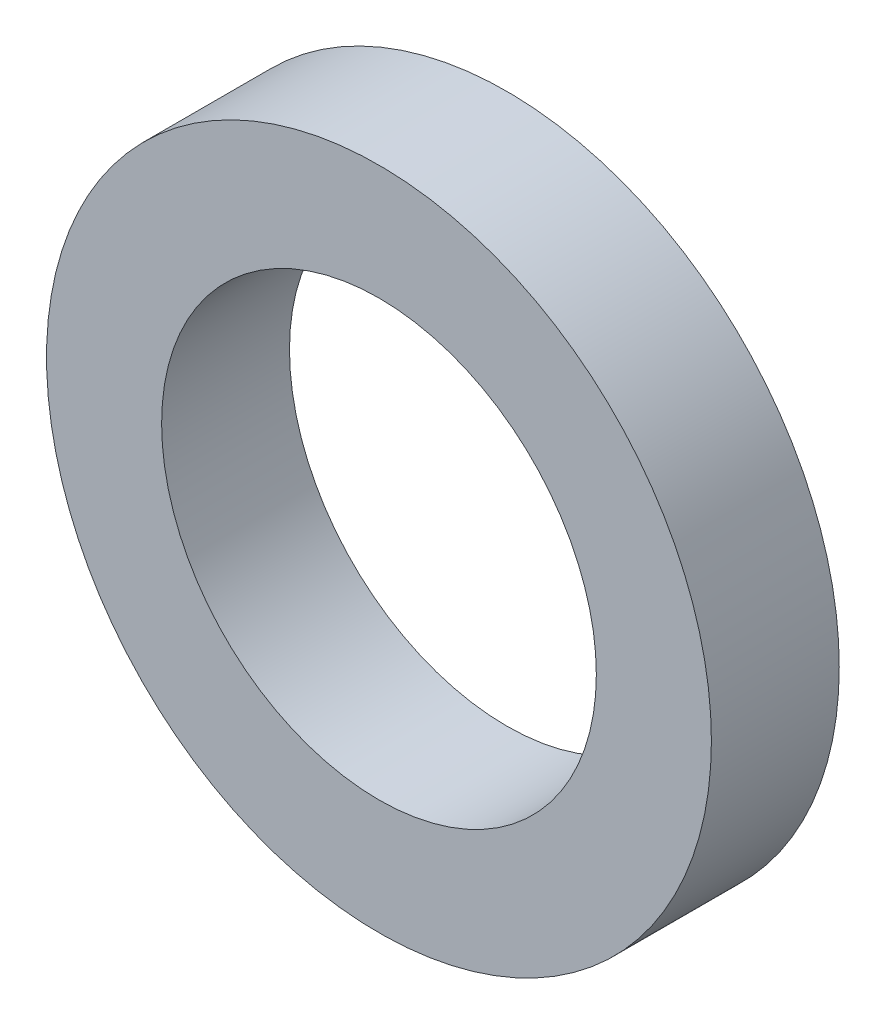
ISO-10303-21;
HEADER;
FILE_DESCRIPTION(('STEP AP214'),'2;1');
FILE_NAME('part.step','',(''),(''),'','','');
FILE_SCHEMA(('AUTOMOTIVE_DESIGN { 1 0 10303 214 1 1 1 1 }'));
ENDSEC;
DATA;
#1=APPLICATION_CONTEXT('core data for automotive mechanical design processes');
#2=APPLICATION_PROTOCOL_DEFINITION('international standard','automotive_design',2000,#1);
#3=PRODUCT_CONTEXT('',#1,'mechanical');
#4=PRODUCT('Part','Part','',(#3));
#5=PRODUCT_RELATED_PRODUCT_CATEGORY('part','',(#4));
#6=PRODUCT_DEFINITION_FORMATION('','',#4);
#7=PRODUCT_DEFINITION_CONTEXT('part definition',#1,'design');
#8=PRODUCT_DEFINITION('design','',#6,#7);
#9=PRODUCT_DEFINITION_SHAPE('','',#8);
#10=(LENGTH_UNIT() NAMED_UNIT(*) SI_UNIT(.MILLI.,.METRE.));
#11=(NAMED_UNIT(*) PLANE_ANGLE_UNIT() SI_UNIT($,.RADIAN.));
#12=(NAMED_UNIT(*) SI_UNIT($,.STERADIAN.) SOLID_ANGLE_UNIT());
#13=UNCERTAINTY_MEASURE_WITH_UNIT(LENGTH_MEASURE(1.E-05),#10,'distance_accuracy_value','');
#14=(GEOMETRIC_REPRESENTATION_CONTEXT(3) GLOBAL_UNCERTAINTY_ASSIGNED_CONTEXT((#13)) GLOBAL_UNIT_ASSIGNED_CONTEXT((#10,
#11,#12)) REPRESENTATION_CONTEXT('',''));
#15=CARTESIAN_POINT('',(0.,0.,0.));
#16=DIRECTION('',(0.,0.,1.));
#17=DIRECTION('',(1.,0.,0.));
#18=AXIS2_PLACEMENT_3D('',#15,#16,#17);
#19=CARTESIAN_POINT('',(0.,0.,5.));
#20=DIRECTION('',(0.,0.,-1.));
#21=DIRECTION('',(-1.,0.,0.));
#22=AXIS2_PLACEMENT_3D('',#19,#20,#21);
#23=CYLINDRICAL_SURFACE('',#22,13.);
#24=CARTESIAN_POINT('',(0.,0.,5.));
#25=DIRECTION('',(0.,0.,1.));
#26=DIRECTION('',(1.,0.,0.));
#27=AXIS2_PLACEMENT_3D('',#24,#25,#26);
#28=CIRCLE('',#27,13.);
#29=CARTESIAN_POINT('',(13.,0.,5.));
#30=VERTEX_POINT('',#29);
#31=EDGE_CURVE('E10',#30,#30,#28,.T.);
#32=ORIENTED_EDGE('',*,*,#31,.F.);
#33=EDGE_LOOP('',(#32));
#34=FACE_BOUND('',#33,.T.);
#35=CARTESIAN_POINT('',(0.,0.,0.));
#36=DIRECTION('',(0.,0.,1.));
#37=DIRECTION('',(1.,0.,0.));
#38=AXIS2_PLACEMENT_3D('',#35,#36,#37);
#39=CIRCLE('',#38,13.);
#40=CARTESIAN_POINT('',(13.,0.,0.));
#41=VERTEX_POINT('',#40);
#42=EDGE_CURVE('E42',#41,#41,#39,.T.);
#43=ORIENTED_EDGE('',*,*,#42,.T.);
#44=EDGE_LOOP('',(#43));
#45=FACE_BOUND('',#44,.T.);
#46=ADVANCED_FACE('F39',(#34,#45),#23,.T.);
#47=CARTESIAN_POINT('',(0.,0.,5.));
#48=DIRECTION('',(0.,0.,1.));
#49=DIRECTION('',(1.,0.,0.));
#50=AXIS2_PLACEMENT_3D('',#47,#48,#49);
#51=PLANE('',#50);
#52=CARTESIAN_POINT('',(0.,0.,5.));
#53=DIRECTION('',(0.,0.,1.));
#54=DIRECTION('',(1.,0.,0.));
#55=AXIS2_PLACEMENT_3D('',#52,#53,#54);
#56=CIRCLE('',#55,8.5);
#57=CARTESIAN_POINT('',(8.5,0.,5.));
#58=VERTEX_POINT('',#57);
#59=EDGE_CURVE('E53',#58,#58,#56,.T.);
#60=ORIENTED_EDGE('',*,*,#59,.F.);
#61=EDGE_LOOP('',(#60));
#62=FACE_BOUND('',#61,.T.);
#63=ORIENTED_EDGE('',*,*,#31,.T.);
#64=EDGE_LOOP('',(#63));
#65=FACE_BOUND('',#64,.T.);
#66=ADVANCED_FACE('F70',(#62,#65),#51,.T.);
#67=CARTESIAN_POINT('',(0.,0.,0.));
#68=DIRECTION('',(0.,0.,1.));
#69=DIRECTION('',(1.,0.,0.));
#70=AXIS2_PLACEMENT_3D('',#67,#68,#69);
#71=PLANE('',#70);
#72=CARTESIAN_POINT('',(0.,0.,0.));
#73=DIRECTION('',(0.,0.,1.));
#74=DIRECTION('',(1.,0.,0.));
#75=AXIS2_PLACEMENT_3D('',#72,#73,#74);
#76=CIRCLE('',#75,8.5);
#77=CARTESIAN_POINT('',(8.5,0.,0.));
#78=VERTEX_POINT('',#77);
#79=EDGE_CURVE('E51',#78,#78,#76,.T.);
#80=ORIENTED_EDGE('',*,*,#79,.T.);
#81=EDGE_LOOP('',(#80));
#82=FACE_BOUND('',#81,.T.);
#83=ORIENTED_EDGE('',*,*,#42,.F.);
#84=EDGE_LOOP('',(#83));
#85=FACE_BOUND('',#84,.T.);
#86=ADVANCED_FACE('F61',(#82,#85),#71,.F.);
#87=CARTESIAN_POINT('',(0.,0.,0.));
#88=DIRECTION('',(0.,0.,1.));
#89=DIRECTION('',(1.,0.,0.));
#90=AXIS2_PLACEMENT_3D('',#87,#88,#89);
#91=CYLINDRICAL_SURFACE('',#90,8.5);
#92=ORIENTED_EDGE('',*,*,#79,.F.);
#93=EDGE_LOOP('',(#92));
#94=FACE_BOUND('',#93,.T.);
#95=ORIENTED_EDGE('',*,*,#59,.T.);
#96=EDGE_LOOP('',(#95));
#97=FACE_BOUND('',#96,.T.);
#98=ADVANCED_FACE('F64',(#94,#97),#91,.F.);
#99=CLOSED_SHELL('',(#46,#66,#86,#98));
#100=MANIFOLD_SOLID_BREP('B2',#99);
#101=ADVANCED_BREP_SHAPE_REPRESENTATION('',(#18,#100),#14);
#102=SHAPE_DEFINITION_REPRESENTATION(#9,#101);
ENDSEC;
END-ISO-10303-21;
